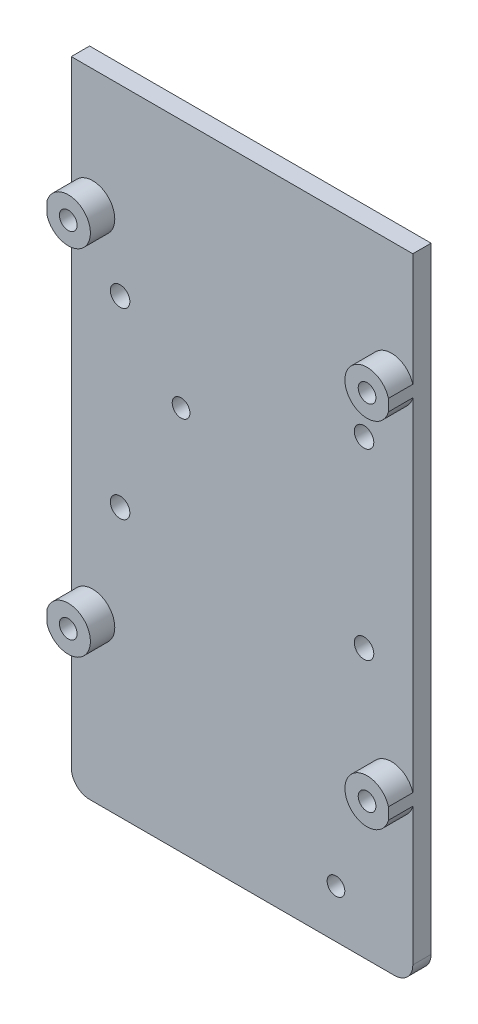
ISO-10303-21;
HEADER;
FILE_DESCRIPTION(('STEP AP214'),'2;1');
FILE_NAME('part.step','',(''),(''),'','','');
FILE_SCHEMA(('AUTOMOTIVE_DESIGN { 1 0 10303 214 1 1 1 1 }'));
ENDSEC;
DATA;
#1=APPLICATION_CONTEXT('core data for automotive mechanical design processes');
#2=APPLICATION_PROTOCOL_DEFINITION('international standard','automotive_design',2000,#1);
#3=PRODUCT_CONTEXT('',#1,'mechanical');
#4=PRODUCT('Part','Part','',(#3));
#5=PRODUCT_RELATED_PRODUCT_CATEGORY('part','',(#4));
#6=PRODUCT_DEFINITION_FORMATION('','',#4);
#7=PRODUCT_DEFINITION_CONTEXT('part definition',#1,'design');
#8=PRODUCT_DEFINITION('design','',#6,#7);
#9=PRODUCT_DEFINITION_SHAPE('','',#8);
#10=(LENGTH_UNIT() NAMED_UNIT(*) SI_UNIT(.MILLI.,.METRE.));
#11=(NAMED_UNIT(*) PLANE_ANGLE_UNIT() SI_UNIT($,.RADIAN.));
#12=(NAMED_UNIT(*) SI_UNIT($,.STERADIAN.) SOLID_ANGLE_UNIT());
#13=UNCERTAINTY_MEASURE_WITH_UNIT(LENGTH_MEASURE(1.E-05),#10,'distance_accuracy_value','');
#14=(GEOMETRIC_REPRESENTATION_CONTEXT(3) GLOBAL_UNCERTAINTY_ASSIGNED_CONTEXT((#13)) GLOBAL_UNIT_ASSIGNED_CONTEXT((#10,
#11,#12)) REPRESENTATION_CONTEXT('',''));
#15=CARTESIAN_POINT('',(0.,0.,0.));
#16=DIRECTION('',(0.,0.,1.));
#17=DIRECTION('',(1.,0.,0.));
#18=AXIS2_PLACEMENT_3D('',#15,#16,#17);
#19=CARTESIAN_POINT('',(-55.5668385634465,-35.1317121332508,3.));
#20=DIRECTION('',(0.,0.,1.));
#21=DIRECTION('',(1.,0.,0.));
#22=AXIS2_PLACEMENT_3D('',#19,#20,#21);
#23=PLANE('',#22);
#24=CARTESIAN_POINT('',(-50.5668385634462,35.8682878667493,3.));
#25=DIRECTION('',(0.,0.,1.));
#26=DIRECTION('',(1.,0.,0.));
#27=AXIS2_PLACEMENT_3D('',#24,#25,#26);
#28=CIRCLE('',#27,1.60000000000023);
#29=CARTESIAN_POINT('',(-48.966838563446,35.8682878667493,3.));
#30=VERTEX_POINT('',#29);
#31=EDGE_CURVE('E262',#30,#30,#28,.T.);
#32=ORIENTED_EDGE('',*,*,#31,.F.);
#33=EDGE_LOOP('',(#32));
#34=FACE_BOUND('',#33,.T.);
#35=CARTESIAN_POINT('',(-50.5668385634463,5.86828786674928,3.));
#36=DIRECTION('',(0.,0.,1.));
#37=DIRECTION('',(1.,0.,0.));
#38=AXIS2_PLACEMENT_3D('',#35,#36,#37);
#39=CIRCLE('',#38,1.60000000000001);
#40=CARTESIAN_POINT('',(-48.9668385634463,5.86828786674928,3.));
#41=VERTEX_POINT('',#40);
#42=EDGE_CURVE('E256',#41,#41,#39,.T.);
#43=ORIENTED_EDGE('',*,*,#42,.F.);
#44=EDGE_LOOP('',(#43));
#45=FACE_BOUND('',#44,.T.);
#46=CARTESIAN_POINT('',(-10.5668385634465,5.86828786674929,3.));
#47=DIRECTION('',(0.,0.,1.));
#48=DIRECTION('',(-1.,0.,0.));
#49=AXIS2_PLACEMENT_3D('',#46,#47,#48);
#50=CIRCLE('',#49,1.60000000000001);
#51=CARTESIAN_POINT('',(-12.1668385634465,5.86828786674929,3.));
#52=VERTEX_POINT('',#51);
#53=EDGE_CURVE('E250',#52,#52,#50,.T.);
#54=ORIENTED_EDGE('',*,*,#53,.F.);
#55=EDGE_LOOP('',(#54));
#56=FACE_BOUND('',#55,.T.);
#57=CARTESIAN_POINT('',(-10.5668385634465,35.8682878667493,3.));
#58=DIRECTION('',(0.,0.,1.));
#59=DIRECTION('',(-1.,0.,0.));
#60=AXIS2_PLACEMENT_3D('',#57,#58,#59);
#61=CIRCLE('',#60,1.60000000000023);
#62=CARTESIAN_POINT('',(-12.1668385634468,35.8682878667493,3.));
#63=VERTEX_POINT('',#62);
#64=EDGE_CURVE('E244',#63,#63,#61,.T.);
#65=ORIENTED_EDGE('',*,*,#64,.F.);
#66=EDGE_LOOP('',(#65));
#67=FACE_BOUND('',#66,.T.);
#68=CARTESIAN_POINT('',(-40.5668385634471,24.9682878667495,3.));
#69=DIRECTION('',(0.,0.,1.));
#70=DIRECTION('',(1.,0.,0.));
#71=AXIS2_PLACEMENT_3D('',#68,#69,#70);
#72=CIRCLE('',#71,1.45);
#73=CARTESIAN_POINT('',(-39.1168385634471,24.9682878667495,3.));
#74=VERTEX_POINT('',#73);
#75=EDGE_CURVE('E238',#74,#74,#72,.T.);
#76=ORIENTED_EDGE('',*,*,#75,.F.);
#77=EDGE_LOOP('',(#76));
#78=FACE_BOUND('',#77,.T.);
#79=CARTESIAN_POINT('',(-15.1668385634479,-30.2317121332502,3.));
#80=DIRECTION('',(0.,0.,1.));
#81=DIRECTION('',(1.,0.,0.));
#82=AXIS2_PLACEMENT_3D('',#79,#80,#81);
#83=CIRCLE('',#82,1.45);
#84=CARTESIAN_POINT('',(-13.7168385634479,-30.2317121332502,3.));
#85=VERTEX_POINT('',#84);
#86=EDGE_CURVE('E234',#85,#85,#83,.T.);
#87=ORIENTED_EDGE('',*,*,#86,.F.);
#88=EDGE_LOOP('',(#87));
#89=FACE_BOUND('',#88,.T.);
#90=DIRECTION('',(0.,1.,0.));
#91=VECTOR('',#90,1.);
#92=CARTESIAN_POINT('',(-2.56683856344624,-35.1317121332507,3.));
#93=LINE('',#92,#91);
#94=CARTESIAN_POINT('',(-2.56683856344624,-10.6715630343306,3.));
#95=VERTEX_POINT('',#94);
#96=CARTESIAN_POINT('',(-2.56683856344624,45.4081387678292,3.));
#97=VERTEX_POINT('',#96);
#98=EDGE_CURVE('E52',#95,#97,#93,.T.);
#99=ORIENTED_EDGE('',*,*,#98,.T.);
#100=CARTESIAN_POINT('',(-6.06683856344624,46.3682878667493,3.));
#101=DIRECTION('',(0.,0.,1.));
#102=DIRECTION('',(1.,0.,0.));
#103=AXIS2_PLACEMENT_3D('',#100,#101,#102);
#104=CIRCLE('',#103,3.62930934092936);
#105=CARTESIAN_POINT('',(-2.56683856344624,47.3284369656694,3.));
#106=VERTEX_POINT('',#105);
#107=EDGE_CURVE('E629',#106,#97,#104,.T.);
#108=ORIENTED_EDGE('',*,*,#107,.F.);
#109=CARTESIAN_POINT('',(-2.56683856344624,65.8682878667496,3.));
#110=VERTEX_POINT('',#109);
#111=EDGE_CURVE('E155',#106,#110,#93,.T.);
#112=ORIENTED_EDGE('',*,*,#111,.T.);
#113=DIRECTION('',(-1.,0.,0.));
#114=VECTOR('',#113,1.);
#115=CARTESIAN_POINT('',(-2.56683856344624,65.8682878667496,3.));
#116=LINE('',#115,#114);
#117=CARTESIAN_POINT('',(-58.5668385634464,65.8682878667493,3.));
#118=VERTEX_POINT('',#117);
#119=EDGE_CURVE('E280',#110,#118,#116,.T.);
#120=ORIENTED_EDGE('',*,*,#119,.T.);
#121=DIRECTION('',(0.,-1.,0.));
#122=VECTOR('',#121,1.);
#123=CARTESIAN_POINT('',(-58.5668385634464,65.8682878667493,3.));
#124=LINE('',#123,#122);
#125=CARTESIAN_POINT('',(-58.5668385634464,47.3284369656703,3.));
#126=VERTEX_POINT('',#125);
#127=EDGE_CURVE('E286',#118,#126,#124,.T.);
#128=ORIENTED_EDGE('',*,*,#127,.T.);
#129=CARTESIAN_POINT('',(-55.0668385634466,46.3682878667495,3.));
#130=DIRECTION('',(0.,0.,1.));
#131=DIRECTION('',(1.,0.,0.));
#132=AXIS2_PLACEMENT_3D('',#129,#130,#131);
#133=CIRCLE('',#132,3.62930934092936);
#134=CARTESIAN_POINT('',(-58.5668385634464,45.4081387678288,3.));
#135=VERTEX_POINT('',#134);
#136=EDGE_CURVE('E176',#135,#126,#133,.T.);
#137=ORIENTED_EDGE('',*,*,#136,.F.);
#138=CARTESIAN_POINT('',(-58.5668385634464,-10.6715630343281,3.));
#139=VERTEX_POINT('',#138);
#140=EDGE_CURVE('E38',#135,#139,#124,.T.);
#141=ORIENTED_EDGE('',*,*,#140,.T.);
#142=CARTESIAN_POINT('',(-55.066838563447,-11.6317121332505,3.));
#143=DIRECTION('',(0.,0.,1.));
#144=DIRECTION('',(1.,0.,0.));
#145=AXIS2_PLACEMENT_3D('',#142,#143,#144);
#146=CIRCLE('',#145,3.62930934092936);
#147=CARTESIAN_POINT('',(-58.5668385634464,-12.5918612321729,3.));
#148=VERTEX_POINT('',#147);
#149=EDGE_CURVE('E191',#148,#139,#146,.T.);
#150=ORIENTED_EDGE('',*,*,#149,.F.);
#151=CARTESIAN_POINT('',(-58.5668385634464,-35.1317121332508,3.));
#152=VERTEX_POINT('',#151);
#153=EDGE_CURVE('E209',#148,#152,#124,.T.);
#154=ORIENTED_EDGE('',*,*,#153,.T.);
#155=CARTESIAN_POINT('',(-55.5668385634465,-35.1317121332508,3.));
#156=DIRECTION('',(0.,0.,1.));
#157=DIRECTION('',(1.,0.,0.));
#158=AXIS2_PLACEMENT_3D('',#155,#156,#157);
#159=CIRCLE('',#158,2.99999999999995);
#160=CARTESIAN_POINT('',(-55.5668385634479,-38.1317121332507,3.));
#161=VERTEX_POINT('',#160);
#162=EDGE_CURVE('E271',#152,#161,#159,.T.);
#163=ORIENTED_EDGE('',*,*,#162,.T.);
#164=DIRECTION('',(1.,0.,0.));
#165=VECTOR('',#164,1.);
#166=CARTESIAN_POINT('',(-55.5668385634479,-38.1317121332507,3.));
#167=LINE('',#166,#165);
#168=CARTESIAN_POINT('',(-5.56683856344491,-38.1317121332507,3.));
#169=VERTEX_POINT('',#168);
#170=EDGE_CURVE('E274',#161,#169,#167,.T.);
#171=ORIENTED_EDGE('',*,*,#170,.T.);
#172=CARTESIAN_POINT('',(-5.56683856344638,-35.1317121332506,3.));
#173=DIRECTION('',(0.,0.,1.));
#174=DIRECTION('',(1.,0.,0.));
#175=AXIS2_PLACEMENT_3D('',#172,#173,#174);
#176=CIRCLE('',#175,3.00000000000013);
#177=CARTESIAN_POINT('',(-2.56683856344624,-35.1317121332507,3.));
#178=VERTEX_POINT('',#177);
#179=EDGE_CURVE('E277',#169,#178,#176,.T.);
#180=ORIENTED_EDGE('',*,*,#179,.T.);
#181=CARTESIAN_POINT('',(-2.56683856344624,-12.5918612321708,3.));
#182=VERTEX_POINT('',#181);
#183=EDGE_CURVE('E58',#178,#182,#93,.T.);
#184=ORIENTED_EDGE('',*,*,#183,.T.);
#185=CARTESIAN_POINT('',(-6.06683856344624,-11.6317121332507,3.));
#186=DIRECTION('',(0.,0.,1.));
#187=DIRECTION('',(1.,0.,0.));
#188=AXIS2_PLACEMENT_3D('',#185,#186,#187);
#189=CIRCLE('',#188,3.62930934092936);
#190=EDGE_CURVE('E156',#95,#182,#189,.T.);
#191=ORIENTED_EDGE('',*,*,#190,.F.);
#192=EDGE_LOOP('',(#99,#108,#112,#120,#128,#137,#141,#150,#154,#163,#171,#180,#184,#191));
#193=FACE_BOUND('',#192,.T.);
#194=ADVANCED_FACE('F34',(#34,#45,#56,#67,#78,#89,#193),#23,.T.);
#195=CARTESIAN_POINT('',(-55.5668385634465,-35.1317121332508,3.));
#196=DIRECTION('',(0.,0.,-1.));
#197=DIRECTION('',(-1.,0.,0.));
#198=AXIS2_PLACEMENT_3D('',#195,#196,#197);
#199=CYLINDRICAL_SURFACE('',#198,2.99999999999995);
#200=CARTESIAN_POINT('',(-55.5668385634465,-35.1317121332508,0.));
#201=DIRECTION('',(0.,0.,1.));
#202=DIRECTION('',(1.,0.,0.));
#203=AXIS2_PLACEMENT_3D('',#200,#201,#202);
#204=CIRCLE('',#203,2.99999999999995);
#205=CARTESIAN_POINT('',(-58.5668385634464,-35.1317121332508,0.));
#206=VERTEX_POINT('',#205);
#207=CARTESIAN_POINT('',(-55.5668385634479,-38.1317121332507,0.));
#208=VERTEX_POINT('',#207);
#209=EDGE_CURVE('E268',#206,#208,#204,.T.);
#210=ORIENTED_EDGE('',*,*,#209,.T.);
#211=DIRECTION('',(0.,0.,-1.));
#212=VECTOR('',#211,1.);
#213=CARTESIAN_POINT('',(-55.5668385634479,-38.1317121332507,3.));
#214=LINE('',#213,#212);
#215=EDGE_CURVE('E11',#161,#208,#214,.T.);
#216=ORIENTED_EDGE('',*,*,#215,.F.);
#217=ORIENTED_EDGE('',*,*,#162,.F.);
#218=DIRECTION('',(0.,0.,-1.));
#219=VECTOR('',#218,1.);
#220=CARTESIAN_POINT('',(-58.5668385634464,-35.1317121332508,3.));
#221=LINE('',#220,#219);
#222=EDGE_CURVE('E288',#152,#206,#221,.T.);
#223=ORIENTED_EDGE('',*,*,#222,.T.);
#224=EDGE_LOOP('',(#210,#216,#217,#223));
#225=FACE_BOUND('',#224,.T.);
#226=ADVANCED_FACE('F36',(#225),#199,.T.);
#227=CARTESIAN_POINT('',(-55.5668385634479,-38.1317121332507,3.));
#228=DIRECTION('',(0.,1.,0.));
#229=DIRECTION('',(0.,0.,1.));
#230=AXIS2_PLACEMENT_3D('',#227,#228,#229);
#231=PLANE('',#230);
#232=DIRECTION('',(1.,0.,0.));
#233=VECTOR('',#232,1.);
#234=CARTESIAN_POINT('',(-55.5668385634479,-38.1317121332507,0.));
#235=LINE('',#234,#233);
#236=CARTESIAN_POINT('',(-5.56683856344491,-38.1317121332507,0.));
#237=VERTEX_POINT('',#236);
#238=EDGE_CURVE('E309',#208,#237,#235,.T.);
#239=ORIENTED_EDGE('',*,*,#238,.T.);
#240=DIRECTION('',(0.,0.,-1.));
#241=VECTOR('',#240,1.);
#242=CARTESIAN_POINT('',(-5.56683856344491,-38.1317121332507,3.));
#243=LINE('',#242,#241);
#244=EDGE_CURVE('E44',#169,#237,#243,.T.);
#245=ORIENTED_EDGE('',*,*,#244,.F.);
#246=ORIENTED_EDGE('',*,*,#170,.F.);
#247=ORIENTED_EDGE('',*,*,#215,.T.);
#248=EDGE_LOOP('',(#239,#245,#246,#247));
#249=FACE_BOUND('',#248,.T.);
#250=ADVANCED_FACE('F324',(#249),#231,.F.);
#251=CARTESIAN_POINT('',(-5.56683856344638,-35.1317121332506,3.));
#252=DIRECTION('',(0.,0.,-1.));
#253=DIRECTION('',(-1.,0.,0.));
#254=AXIS2_PLACEMENT_3D('',#251,#252,#253);
#255=CYLINDRICAL_SURFACE('',#254,3.00000000000013);
#256=CARTESIAN_POINT('',(-5.56683856344638,-35.1317121332506,0.));
#257=DIRECTION('',(0.,0.,1.));
#258=DIRECTION('',(1.,0.,0.));
#259=AXIS2_PLACEMENT_3D('',#256,#257,#258);
#260=CIRCLE('',#259,3.00000000000013);
#261=CARTESIAN_POINT('',(-2.56683856344624,-35.1317121332507,0.));
#262=VERTEX_POINT('',#261);
#263=EDGE_CURVE('E308',#237,#262,#260,.T.);
#264=ORIENTED_EDGE('',*,*,#263,.T.);
#265=DIRECTION('',(0.,0.,-1.));
#266=VECTOR('',#265,1.);
#267=CARTESIAN_POINT('',(-2.56683856344624,-35.1317121332507,3.));
#268=LINE('',#267,#266);
#269=EDGE_CURVE('E292',#178,#262,#268,.T.);
#270=ORIENTED_EDGE('',*,*,#269,.F.);
#271=ORIENTED_EDGE('',*,*,#179,.F.);
#272=ORIENTED_EDGE('',*,*,#244,.T.);
#273=EDGE_LOOP('',(#264,#270,#271,#272));
#274=FACE_BOUND('',#273,.T.);
#275=ADVANCED_FACE('F336',(#274),#255,.T.);
#276=CARTESIAN_POINT('',(-2.56683856344624,-35.1317121332507,3.));
#277=DIRECTION('',(-1.,0.,0.));
#278=DIRECTION('',(0.,0.,1.));
#279=AXIS2_PLACEMENT_3D('',#276,#277,#278);
#280=PLANE('',#279);
#281=DIRECTION('',(0.,1.,0.));
#282=VECTOR('',#281,1.);
#283=CARTESIAN_POINT('',(-2.56683856344624,-35.1317121332507,0.));
#284=LINE('',#283,#282);
#285=CARTESIAN_POINT('',(-2.56683856344624,65.8682878667496,0.));
#286=VERTEX_POINT('',#285);
#287=EDGE_CURVE('E306',#262,#286,#284,.T.);
#288=ORIENTED_EDGE('',*,*,#287,.T.);
#289=DIRECTION('',(0.,0.,-1.));
#290=VECTOR('',#289,1.);
#291=CARTESIAN_POINT('',(-2.56683856344624,65.8682878667496,3.));
#292=LINE('',#291,#290);
#293=EDGE_CURVE('E295',#110,#286,#292,.T.);
#294=ORIENTED_EDGE('',*,*,#293,.F.);
#295=ORIENTED_EDGE('',*,*,#111,.F.);
#296=DIRECTION('',(0.,0.,-1.));
#297=VECTOR('',#296,1.);
#298=CARTESIAN_POINT('',(-2.56683856344624,47.3284369656694,7.));
#299=LINE('',#298,#297);
#300=CARTESIAN_POINT('',(-2.56683856344624,47.3284369656694,7.));
#301=VERTEX_POINT('',#300);
#302=EDGE_CURVE('E142',#301,#106,#299,.T.);
#303=ORIENTED_EDGE('',*,*,#302,.F.);
#304=DIRECTION('',(0.,1.,0.));
#305=VECTOR('',#304,1.);
#306=CARTESIAN_POINT('',(-2.56683856344624,0.,7.));
#307=LINE('',#306,#305);
#308=CARTESIAN_POINT('',(-2.56683856344624,45.4081387678292,7.));
#309=VERTEX_POINT('',#308);
#310=EDGE_CURVE('E147',#309,#301,#307,.T.);
#311=ORIENTED_EDGE('',*,*,#310,.F.);
#312=DIRECTION('',(0.,0.,-1.));
#313=VECTOR('',#312,1.);
#314=CARTESIAN_POINT('',(-2.56683856344624,45.4081387678292,7.));
#315=LINE('',#314,#313);
#316=EDGE_CURVE('E144',#309,#97,#315,.T.);
#317=ORIENTED_EDGE('',*,*,#316,.T.);
#318=ORIENTED_EDGE('',*,*,#98,.F.);
#319=DIRECTION('',(0.,0.,-1.));
#320=VECTOR('',#319,1.);
#321=CARTESIAN_POINT('',(-2.56683856344624,-10.6715630343306,7.));
#322=LINE('',#321,#320);
#323=CARTESIAN_POINT('',(-2.56683856344624,-10.6715630343306,7.));
#324=VERTEX_POINT('',#323);
#325=EDGE_CURVE('E173',#324,#95,#322,.T.);
#326=ORIENTED_EDGE('',*,*,#325,.F.);
#327=DIRECTION('',(0.,1.,0.));
#328=VECTOR('',#327,1.);
#329=CARTESIAN_POINT('',(-2.56683856344624,0.,7.));
#330=LINE('',#329,#328);
#331=CARTESIAN_POINT('',(-2.56683856344624,-12.5918612321708,7.));
#332=VERTEX_POINT('',#331);
#333=EDGE_CURVE('E165',#332,#324,#330,.T.);
#334=ORIENTED_EDGE('',*,*,#333,.F.);
#335=DIRECTION('',(0.,0.,-1.));
#336=VECTOR('',#335,1.);
#337=CARTESIAN_POINT('',(-2.56683856344624,-12.5918612321708,7.));
#338=LINE('',#337,#336);
#339=EDGE_CURVE('E169',#332,#182,#338,.T.);
#340=ORIENTED_EDGE('',*,*,#339,.T.);
#341=ORIENTED_EDGE('',*,*,#183,.F.);
#342=ORIENTED_EDGE('',*,*,#269,.T.);
#343=EDGE_LOOP('',(#288,#294,#295,#303,#311,#317,#318,#326,#334,#340,#341,#342));
#344=FACE_BOUND('',#343,.T.);
#345=ADVANCED_FACE('F153',(#344),#280,.F.);
#346=CARTESIAN_POINT('',(-2.56683856344624,65.8682878667496,3.));
#347=DIRECTION('',(0.,-1.,0.));
#348=DIRECTION('',(1.,0.,0.));
#349=AXIS2_PLACEMENT_3D('',#346,#347,#348);
#350=PLANE('',#349);
#351=DIRECTION('',(-1.,0.,0.));
#352=VECTOR('',#351,1.);
#353=CARTESIAN_POINT('',(-2.56683856344624,65.8682878667496,0.));
#354=LINE('',#353,#352);
#355=CARTESIAN_POINT('',(-58.5668385634464,65.8682878667493,0.));
#356=VERTEX_POINT('',#355);
#357=EDGE_CURVE('E304',#286,#356,#354,.T.);
#358=ORIENTED_EDGE('',*,*,#357,.T.);
#359=DIRECTION('',(0.,0.,-1.));
#360=VECTOR('',#359,1.);
#361=CARTESIAN_POINT('',(-58.5668385634464,65.8682878667493,3.));
#362=LINE('',#361,#360);
#363=EDGE_CURVE('E298',#118,#356,#362,.T.);
#364=ORIENTED_EDGE('',*,*,#363,.F.);
#365=ORIENTED_EDGE('',*,*,#119,.F.);
#366=ORIENTED_EDGE('',*,*,#293,.T.);
#367=EDGE_LOOP('',(#358,#364,#365,#366));
#368=FACE_BOUND('',#367,.T.);
#369=ADVANCED_FACE('F333',(#368),#350,.F.);
#370=CARTESIAN_POINT('',(-58.5668385634464,65.8682878667493,3.));
#371=DIRECTION('',(1.,0.,0.));
#372=DIRECTION('',(0.,0.,-1.));
#373=AXIS2_PLACEMENT_3D('',#370,#371,#372);
#374=PLANE('',#373);
#375=DIRECTION('',(0.,-1.,0.));
#376=VECTOR('',#375,1.);
#377=CARTESIAN_POINT('',(-58.5668385634464,65.8682878667493,0.));
#378=LINE('',#377,#376);
#379=EDGE_CURVE('E275',#356,#206,#378,.T.);
#380=ORIENTED_EDGE('',*,*,#379,.T.);
#381=ORIENTED_EDGE('',*,*,#222,.F.);
#382=ORIENTED_EDGE('',*,*,#153,.F.);
#383=DIRECTION('',(0.,0.,-1.));
#384=VECTOR('',#383,1.);
#385=CARTESIAN_POINT('',(-58.5668385634464,-12.5918612321729,7.));
#386=LINE('',#385,#384);
#387=CARTESIAN_POINT('',(-58.5668385634464,-12.5918612321729,7.));
#388=VERTEX_POINT('',#387);
#389=EDGE_CURVE('E213',#388,#148,#386,.T.);
#390=ORIENTED_EDGE('',*,*,#389,.F.);
#391=DIRECTION('',(0.,-1.,0.));
#392=VECTOR('',#391,1.);
#393=CARTESIAN_POINT('',(-58.5668385634464,0.,7.));
#394=LINE('',#393,#392);
#395=CARTESIAN_POINT('',(-58.5668385634464,-10.6715630343281,7.));
#396=VERTEX_POINT('',#395);
#397=EDGE_CURVE('E195',#396,#388,#394,.T.);
#398=ORIENTED_EDGE('',*,*,#397,.F.);
#399=DIRECTION('',(0.,0.,-1.));
#400=VECTOR('',#399,1.);
#401=CARTESIAN_POINT('',(-58.5668385634464,-10.6715630343281,7.));
#402=LINE('',#401,#400);
#403=EDGE_CURVE('E200',#396,#139,#402,.T.);
#404=ORIENTED_EDGE('',*,*,#403,.T.);
#405=ORIENTED_EDGE('',*,*,#140,.F.);
#406=DIRECTION('',(0.,0.,-1.));
#407=VECTOR('',#406,1.);
#408=CARTESIAN_POINT('',(-58.5668385634464,45.4081387678288,7.));
#409=LINE('',#408,#407);
#410=CARTESIAN_POINT('',(-58.5668385634464,45.4081387678288,7.));
#411=VERTEX_POINT('',#410);
#412=EDGE_CURVE('E189',#411,#135,#409,.T.);
#413=ORIENTED_EDGE('',*,*,#412,.F.);
#414=DIRECTION('',(0.,-1.,0.));
#415=VECTOR('',#414,1.);
#416=CARTESIAN_POINT('',(-58.5668385634464,0.,7.));
#417=LINE('',#416,#415);
#418=CARTESIAN_POINT('',(-58.5668385634464,47.3284369656703,7.));
#419=VERTEX_POINT('',#418);
#420=EDGE_CURVE('E180',#419,#411,#417,.T.);
#421=ORIENTED_EDGE('',*,*,#420,.F.);
#422=DIRECTION('',(0.,0.,-1.));
#423=VECTOR('',#422,1.);
#424=CARTESIAN_POINT('',(-58.5668385634464,47.3284369656703,7.));
#425=LINE('',#424,#423);
#426=EDGE_CURVE('E185',#419,#126,#425,.T.);
#427=ORIENTED_EDGE('',*,*,#426,.T.);
#428=ORIENTED_EDGE('',*,*,#127,.F.);
#429=ORIENTED_EDGE('',*,*,#363,.T.);
#430=EDGE_LOOP('',(#380,#381,#382,#390,#398,#404,#405,#413,#421,#427,#428,#429));
#431=FACE_BOUND('',#430,.T.);
#432=ADVANCED_FACE('F328',(#431),#374,.F.);
#433=CARTESIAN_POINT('',(-55.5668385634465,-35.1317121332508,0.));
#434=DIRECTION('',(0.,0.,1.));
#435=DIRECTION('',(1.,0.,0.));
#436=AXIS2_PLACEMENT_3D('',#433,#434,#435);
#437=PLANE('',#436);
#438=CARTESIAN_POINT('',(-55.0668385634466,46.3682878667495,0.));
#439=DIRECTION('',(0.,0.,1.));
#440=DIRECTION('',(-1.,0.,0.));
#441=AXIS2_PLACEMENT_3D('',#438,#439,#440);
#442=CIRCLE('',#441,1.45);
#443=CARTESIAN_POINT('',(-56.5168385634466,46.3682878667495,0.));
#444=VERTEX_POINT('',#443);
#445=EDGE_CURVE('E203',#444,#444,#442,.T.);
#446=ORIENTED_EDGE('',*,*,#445,.T.);
#447=EDGE_LOOP('',(#446));
#448=FACE_BOUND('',#447,.T.);
#449=CARTESIAN_POINT('',(-55.066838563447,-11.6317121332505,0.));
#450=DIRECTION('',(0.,0.,1.));
#451=DIRECTION('',(-1.,0.,0.));
#452=AXIS2_PLACEMENT_3D('',#449,#450,#451);
#453=CIRCLE('',#452,1.45);
#454=CARTESIAN_POINT('',(-56.516838563447,-11.6317121332505,0.));
#455=VERTEX_POINT('',#454);
#456=EDGE_CURVE('E221',#455,#455,#453,.T.);
#457=ORIENTED_EDGE('',*,*,#456,.T.);
#458=EDGE_LOOP('',(#457));
#459=FACE_BOUND('',#458,.T.);
#460=CARTESIAN_POINT('',(-6.06683856344624,-11.6317121332507,0.));
#461=DIRECTION('',(0.,0.,1.));
#462=DIRECTION('',(1.,0.,0.));
#463=AXIS2_PLACEMENT_3D('',#460,#461,#462);
#464=CIRCLE('',#463,1.45);
#465=CARTESIAN_POINT('',(-4.61683856344624,-11.6317121332507,0.));
#466=VERTEX_POINT('',#465);
#467=EDGE_CURVE('E225',#466,#466,#464,.T.);
#468=ORIENTED_EDGE('',*,*,#467,.T.);
#469=EDGE_LOOP('',(#468));
#470=FACE_BOUND('',#469,.T.);
#471=CARTESIAN_POINT('',(-6.06683856344624,46.3682878667493,0.));
#472=DIRECTION('',(0.,0.,1.));
#473=DIRECTION('',(1.,0.,0.));
#474=AXIS2_PLACEMENT_3D('',#471,#472,#473);
#475=CIRCLE('',#474,1.45);
#476=CARTESIAN_POINT('',(-4.61683856344624,46.3682878667493,0.));
#477=VERTEX_POINT('',#476);
#478=EDGE_CURVE('E229',#477,#477,#475,.T.);
#479=ORIENTED_EDGE('',*,*,#478,.T.);
#480=EDGE_LOOP('',(#479));
#481=FACE_BOUND('',#480,.T.);
#482=CARTESIAN_POINT('',(-15.1668385634479,-30.2317121332502,0.));
#483=DIRECTION('',(0.,0.,1.));
#484=DIRECTION('',(1.,0.,0.));
#485=AXIS2_PLACEMENT_3D('',#482,#483,#484);
#486=CIRCLE('',#485,1.45);
#487=CARTESIAN_POINT('',(-13.7168385634479,-30.2317121332502,0.));
#488=VERTEX_POINT('',#487);
#489=EDGE_CURVE('E235',#488,#488,#486,.T.);
#490=ORIENTED_EDGE('',*,*,#489,.T.);
#491=EDGE_LOOP('',(#490));
#492=FACE_BOUND('',#491,.T.);
#493=CARTESIAN_POINT('',(-40.5668385634471,24.9682878667495,0.));
#494=DIRECTION('',(0.,0.,1.));
#495=DIRECTION('',(1.,0.,0.));
#496=AXIS2_PLACEMENT_3D('',#493,#494,#495);
#497=CIRCLE('',#496,1.45);
#498=CARTESIAN_POINT('',(-39.1168385634471,24.9682878667495,0.));
#499=VERTEX_POINT('',#498);
#500=EDGE_CURVE('E241',#499,#499,#497,.T.);
#501=ORIENTED_EDGE('',*,*,#500,.T.);
#502=EDGE_LOOP('',(#501));
#503=FACE_BOUND('',#502,.T.);
#504=CARTESIAN_POINT('',(-10.5668385634465,35.8682878667493,0.));
#505=DIRECTION('',(0.,0.,1.));
#506=DIRECTION('',(-1.,0.,0.));
#507=AXIS2_PLACEMENT_3D('',#504,#505,#506);
#508=CIRCLE('',#507,1.60000000000023);
#509=CARTESIAN_POINT('',(-12.1668385634468,35.8682878667493,0.));
#510=VERTEX_POINT('',#509);
#511=EDGE_CURVE('E247',#510,#510,#508,.T.);
#512=ORIENTED_EDGE('',*,*,#511,.T.);
#513=EDGE_LOOP('',(#512));
#514=FACE_BOUND('',#513,.T.);
#515=CARTESIAN_POINT('',(-10.5668385634465,5.86828786674929,0.));
#516=DIRECTION('',(0.,0.,1.));
#517=DIRECTION('',(-1.,0.,0.));
#518=AXIS2_PLACEMENT_3D('',#515,#516,#517);
#519=CIRCLE('',#518,1.60000000000001);
#520=CARTESIAN_POINT('',(-12.1668385634465,5.86828786674929,0.));
#521=VERTEX_POINT('',#520);
#522=EDGE_CURVE('E253',#521,#521,#519,.T.);
#523=ORIENTED_EDGE('',*,*,#522,.T.);
#524=EDGE_LOOP('',(#523));
#525=FACE_BOUND('',#524,.T.);
#526=CARTESIAN_POINT('',(-50.5668385634463,5.86828786674928,0.));
#527=DIRECTION('',(0.,0.,1.));
#528=DIRECTION('',(1.,0.,0.));
#529=AXIS2_PLACEMENT_3D('',#526,#527,#528);
#530=CIRCLE('',#529,1.60000000000001);
#531=CARTESIAN_POINT('',(-48.9668385634463,5.86828786674928,0.));
#532=VERTEX_POINT('',#531);
#533=EDGE_CURVE('E259',#532,#532,#530,.T.);
#534=ORIENTED_EDGE('',*,*,#533,.T.);
#535=EDGE_LOOP('',(#534));
#536=FACE_BOUND('',#535,.T.);
#537=CARTESIAN_POINT('',(-50.5668385634462,35.8682878667493,0.));
#538=DIRECTION('',(0.,0.,1.));
#539=DIRECTION('',(1.,0.,0.));
#540=AXIS2_PLACEMENT_3D('',#537,#538,#539);
#541=CIRCLE('',#540,1.60000000000023);
#542=CARTESIAN_POINT('',(-48.966838563446,35.8682878667493,0.));
#543=VERTEX_POINT('',#542);
#544=EDGE_CURVE('E265',#543,#543,#541,.T.);
#545=ORIENTED_EDGE('',*,*,#544,.T.);
#546=EDGE_LOOP('',(#545));
#547=FACE_BOUND('',#546,.T.);
#548=ORIENTED_EDGE('',*,*,#209,.F.);
#549=ORIENTED_EDGE('',*,*,#379,.F.);
#550=ORIENTED_EDGE('',*,*,#357,.F.);
#551=ORIENTED_EDGE('',*,*,#287,.F.);
#552=ORIENTED_EDGE('',*,*,#263,.F.);
#553=ORIENTED_EDGE('',*,*,#238,.F.);
#554=EDGE_LOOP('',(#548,#549,#550,#551,#552,#553));
#555=FACE_BOUND('',#554,.T.);
#556=ADVANCED_FACE('F320',(#448,#459,#470,#481,#492,#503,#514,#525,#536,#547,#555),#437,.F.);
#557=CARTESIAN_POINT('',(-50.5668385634462,35.8682878667493,0.));
#558=DIRECTION('',(0.,0.,1.));
#559=DIRECTION('',(1.,0.,0.));
#560=AXIS2_PLACEMENT_3D('',#557,#558,#559);
#561=CYLINDRICAL_SURFACE('',#560,1.60000000000023);
#562=ORIENTED_EDGE('',*,*,#544,.F.);
#563=EDGE_LOOP('',(#562));
#564=FACE_BOUND('',#563,.T.);
#565=ORIENTED_EDGE('',*,*,#31,.T.);
#566=EDGE_LOOP('',(#565));
#567=FACE_BOUND('',#566,.T.);
#568=ADVANCED_FACE('F354',(#564,#567),#561,.F.);
#569=CARTESIAN_POINT('',(-50.5668385634463,5.86828786674928,0.));
#570=DIRECTION('',(0.,0.,1.));
#571=DIRECTION('',(1.,0.,0.));
#572=AXIS2_PLACEMENT_3D('',#569,#570,#571);
#573=CYLINDRICAL_SURFACE('',#572,1.60000000000001);
#574=ORIENTED_EDGE('',*,*,#533,.F.);
#575=EDGE_LOOP('',(#574));
#576=FACE_BOUND('',#575,.T.);
#577=ORIENTED_EDGE('',*,*,#42,.T.);
#578=EDGE_LOOP('',(#577));
#579=FACE_BOUND('',#578,.T.);
#580=ADVANCED_FACE('F380',(#576,#579),#573,.F.);
#581=CARTESIAN_POINT('',(-10.5668385634465,5.86828786674929,0.));
#582=DIRECTION('',(0.,0.,1.));
#583=DIRECTION('',(1.,0.,0.));
#584=AXIS2_PLACEMENT_3D('',#581,#582,#583);
#585=CYLINDRICAL_SURFACE('',#584,1.60000000000001);
#586=ORIENTED_EDGE('',*,*,#522,.F.);
#587=EDGE_LOOP('',(#586));
#588=FACE_BOUND('',#587,.T.);
#589=ORIENTED_EDGE('',*,*,#53,.T.);
#590=EDGE_LOOP('',(#589));
#591=FACE_BOUND('',#590,.T.);
#592=ADVANCED_FACE('F387',(#588,#591),#585,.F.);
#593=CARTESIAN_POINT('',(-10.5668385634465,35.8682878667493,0.));
#594=DIRECTION('',(0.,0.,1.));
#595=DIRECTION('',(1.,0.,0.));
#596=AXIS2_PLACEMENT_3D('',#593,#594,#595);
#597=CYLINDRICAL_SURFACE('',#596,1.60000000000023);
#598=ORIENTED_EDGE('',*,*,#511,.F.);
#599=EDGE_LOOP('',(#598));
#600=FACE_BOUND('',#599,.T.);
#601=ORIENTED_EDGE('',*,*,#64,.T.);
#602=EDGE_LOOP('',(#601));
#603=FACE_BOUND('',#602,.T.);
#604=ADVANCED_FACE('F394',(#600,#603),#597,.F.);
#605=CARTESIAN_POINT('',(-40.5668385634471,24.9682878667495,0.));
#606=DIRECTION('',(0.,0.,1.));
#607=DIRECTION('',(1.,0.,0.));
#608=AXIS2_PLACEMENT_3D('',#605,#606,#607);
#609=CYLINDRICAL_SURFACE('',#608,1.45);
#610=ORIENTED_EDGE('',*,*,#500,.F.);
#611=EDGE_LOOP('',(#610));
#612=FACE_BOUND('',#611,.T.);
#613=ORIENTED_EDGE('',*,*,#75,.T.);
#614=EDGE_LOOP('',(#613));
#615=FACE_BOUND('',#614,.T.);
#616=ADVANCED_FACE('F402',(#612,#615),#609,.F.);
#617=CARTESIAN_POINT('',(-15.1668385634479,-30.2317121332502,0.));
#618=DIRECTION('',(0.,0.,1.));
#619=DIRECTION('',(1.,0.,0.));
#620=AXIS2_PLACEMENT_3D('',#617,#618,#619);
#621=CYLINDRICAL_SURFACE('',#620,1.45);
#622=ORIENTED_EDGE('',*,*,#489,.F.);
#623=EDGE_LOOP('',(#622));
#624=FACE_BOUND('',#623,.T.);
#625=ORIENTED_EDGE('',*,*,#86,.T.);
#626=EDGE_LOOP('',(#625));
#627=FACE_BOUND('',#626,.T.);
#628=ADVANCED_FACE('F410',(#624,#627),#621,.F.);
#629=CARTESIAN_POINT('',(-6.06683856344624,46.3682878667493,0.));
#630=DIRECTION('',(0.,0.,1.));
#631=DIRECTION('',(1.,0.,0.));
#632=AXIS2_PLACEMENT_3D('',#629,#630,#631);
#633=CYLINDRICAL_SURFACE('',#632,1.45);
#634=ORIENTED_EDGE('',*,*,#478,.F.);
#635=EDGE_LOOP('',(#634));
#636=FACE_BOUND('',#635,.T.);
#637=CARTESIAN_POINT('',(-6.06683856344624,46.3682878667493,7.));
#638=DIRECTION('',(0.,0.,1.));
#639=DIRECTION('',(1.,0.,0.));
#640=AXIS2_PLACEMENT_3D('',#637,#638,#639);
#641=CIRCLE('',#640,1.45);
#642=CARTESIAN_POINT('',(-4.61683856344624,46.3682878667493,7.));
#643=VERTEX_POINT('',#642);
#644=EDGE_CURVE('E151',#643,#643,#641,.F.);
#645=ORIENTED_EDGE('',*,*,#644,.F.);
#646=EDGE_LOOP('',(#645));
#647=FACE_BOUND('',#646,.T.);
#648=ADVANCED_FACE('F418',(#636,#647),#633,.F.);
#649=CARTESIAN_POINT('',(-6.06683856344624,-11.6317121332507,0.));
#650=DIRECTION('',(0.,0.,1.));
#651=DIRECTION('',(1.,0.,0.));
#652=AXIS2_PLACEMENT_3D('',#649,#650,#651);
#653=CYLINDRICAL_SURFACE('',#652,1.45);
#654=ORIENTED_EDGE('',*,*,#467,.F.);
#655=EDGE_LOOP('',(#654));
#656=FACE_BOUND('',#655,.T.);
#657=CARTESIAN_POINT('',(-6.06683856344624,-11.6317121332507,7.));
#658=DIRECTION('',(0.,0.,1.));
#659=DIRECTION('',(1.,0.,0.));
#660=AXIS2_PLACEMENT_3D('',#657,#658,#659);
#661=CIRCLE('',#660,1.45);
#662=CARTESIAN_POINT('',(-4.61683856344624,-11.6317121332507,7.));
#663=VERTEX_POINT('',#662);
#664=EDGE_CURVE('E158',#663,#663,#661,.F.);
#665=ORIENTED_EDGE('',*,*,#664,.F.);
#666=EDGE_LOOP('',(#665));
#667=FACE_BOUND('',#666,.T.);
#668=ADVANCED_FACE('F425',(#656,#667),#653,.F.);
#669=CARTESIAN_POINT('',(-55.066838563447,-11.6317121332505,0.));
#670=DIRECTION('',(0.,0.,1.));
#671=DIRECTION('',(1.,0.,0.));
#672=AXIS2_PLACEMENT_3D('',#669,#670,#671);
#673=CYLINDRICAL_SURFACE('',#672,1.45);
#674=ORIENTED_EDGE('',*,*,#456,.F.);
#675=EDGE_LOOP('',(#674));
#676=FACE_BOUND('',#675,.T.);
#677=CARTESIAN_POINT('',(-55.066838563447,-11.6317121332505,7.));
#678=DIRECTION('',(0.,0.,1.));
#679=DIRECTION('',(1.,0.,0.));
#680=AXIS2_PLACEMENT_3D('',#677,#678,#679);
#681=CIRCLE('',#680,1.45);
#682=CARTESIAN_POINT('',(-53.616838563447,-11.6317121332505,7.));
#683=VERTEX_POINT('',#682);
#684=EDGE_CURVE('E192',#683,#683,#681,.F.);
#685=ORIENTED_EDGE('',*,*,#684,.F.);
#686=EDGE_LOOP('',(#685));
#687=FACE_BOUND('',#686,.T.);
#688=ADVANCED_FACE('F433',(#676,#687),#673,.F.);
#689=CARTESIAN_POINT('',(-55.0668385634466,46.3682878667495,0.));
#690=DIRECTION('',(0.,0.,1.));
#691=DIRECTION('',(1.,0.,0.));
#692=AXIS2_PLACEMENT_3D('',#689,#690,#691);
#693=CYLINDRICAL_SURFACE('',#692,1.45);
#694=ORIENTED_EDGE('',*,*,#445,.F.);
#695=EDGE_LOOP('',(#694));
#696=FACE_BOUND('',#695,.T.);
#697=CARTESIAN_POINT('',(-55.0668385634466,46.3682878667495,7.));
#698=DIRECTION('',(0.,0.,1.));
#699=DIRECTION('',(1.,0.,0.));
#700=AXIS2_PLACEMENT_3D('',#697,#698,#699);
#701=CIRCLE('',#700,1.45);
#702=CARTESIAN_POINT('',(-53.6168385634466,46.3682878667495,7.));
#703=VERTEX_POINT('',#702);
#704=EDGE_CURVE('E177',#703,#703,#701,.F.);
#705=ORIENTED_EDGE('',*,*,#704,.F.);
#706=EDGE_LOOP('',(#705));
#707=FACE_BOUND('',#706,.T.);
#708=ADVANCED_FACE('F441',(#696,#707),#693,.F.);
#709=CARTESIAN_POINT('',(-55.066838563447,-11.6317121332505,7.));
#710=DIRECTION('',(0.,0.,-1.));
#711=DIRECTION('',(-1.,0.,0.));
#712=AXIS2_PLACEMENT_3D('',#709,#710,#711);
#713=CYLINDRICAL_SURFACE('',#712,3.62930934092936);
#714=ORIENTED_EDGE('',*,*,#149,.T.);
#715=ORIENTED_EDGE('',*,*,#403,.F.);
#716=CARTESIAN_POINT('',(-55.066838563447,-11.6317121332505,7.));
#717=DIRECTION('',(0.,0.,1.));
#718=DIRECTION('',(1.,0.,0.));
#719=AXIS2_PLACEMENT_3D('',#716,#717,#718);
#720=CIRCLE('',#719,3.62930934092936);
#721=EDGE_CURVE('E198',#388,#396,#720,.T.);
#722=ORIENTED_EDGE('',*,*,#721,.F.);
#723=ORIENTED_EDGE('',*,*,#389,.T.);
#724=EDGE_LOOP('',(#714,#715,#722,#723));
#725=FACE_BOUND('',#724,.T.);
#726=ADVANCED_FACE('F449',(#725),#713,.T.);
#727=CARTESIAN_POINT('',(0.,0.,7.));
#728=DIRECTION('',(0.,0.,1.));
#729=DIRECTION('',(1.,0.,0.));
#730=AXIS2_PLACEMENT_3D('',#727,#728,#729);
#731=PLANE('',#730);
#732=ORIENTED_EDGE('',*,*,#684,.T.);
#733=EDGE_LOOP('',(#732));
#734=FACE_BOUND('',#733,.T.);
#735=ORIENTED_EDGE('',*,*,#397,.T.);
#736=ORIENTED_EDGE('',*,*,#721,.T.);
#737=EDGE_LOOP('',(#735,#736));
#738=FACE_BOUND('',#737,.T.);
#739=ADVANCED_FACE('F457',(#734,#738),#731,.T.);
#740=CARTESIAN_POINT('',(-55.0668385634466,46.3682878667495,7.));
#741=DIRECTION('',(0.,0.,-1.));
#742=DIRECTION('',(-1.,0.,0.));
#743=AXIS2_PLACEMENT_3D('',#740,#741,#742);
#744=CYLINDRICAL_SURFACE('',#743,3.62930934092936);
#745=ORIENTED_EDGE('',*,*,#136,.T.);
#746=ORIENTED_EDGE('',*,*,#426,.F.);
#747=CARTESIAN_POINT('',(-55.0668385634466,46.3682878667495,7.));
#748=DIRECTION('',(0.,0.,1.));
#749=DIRECTION('',(1.,0.,0.));
#750=AXIS2_PLACEMENT_3D('',#747,#748,#749);
#751=CIRCLE('',#750,3.62930934092936);
#752=EDGE_CURVE('E183',#411,#419,#751,.T.);
#753=ORIENTED_EDGE('',*,*,#752,.F.);
#754=ORIENTED_EDGE('',*,*,#412,.T.);
#755=EDGE_LOOP('',(#745,#746,#753,#754));
#756=FACE_BOUND('',#755,.T.);
#757=ADVANCED_FACE('F464',(#756),#744,.T.);
#758=CARTESIAN_POINT('',(0.,0.,7.));
#759=DIRECTION('',(0.,0.,1.));
#760=DIRECTION('',(1.,0.,0.));
#761=AXIS2_PLACEMENT_3D('',#758,#759,#760);
#762=PLANE('',#761);
#763=ORIENTED_EDGE('',*,*,#704,.T.);
#764=EDGE_LOOP('',(#763));
#765=FACE_BOUND('',#764,.T.);
#766=ORIENTED_EDGE('',*,*,#420,.T.);
#767=ORIENTED_EDGE('',*,*,#752,.T.);
#768=EDGE_LOOP('',(#766,#767));
#769=FACE_BOUND('',#768,.T.);
#770=ADVANCED_FACE('F472',(#765,#769),#762,.T.);
#771=CARTESIAN_POINT('',(-6.06683856344624,-11.6317121332507,7.));
#772=DIRECTION('',(0.,0.,-1.));
#773=DIRECTION('',(-1.,0.,0.));
#774=AXIS2_PLACEMENT_3D('',#771,#772,#773);
#775=CYLINDRICAL_SURFACE('',#774,3.62930934092936);
#776=ORIENTED_EDGE('',*,*,#190,.T.);
#777=ORIENTED_EDGE('',*,*,#339,.F.);
#778=CARTESIAN_POINT('',(-6.06683856344624,-11.6317121332507,7.));
#779=DIRECTION('',(0.,0.,1.));
#780=DIRECTION('',(1.,0.,0.));
#781=AXIS2_PLACEMENT_3D('',#778,#779,#780);
#782=CIRCLE('',#781,3.62930934092936);
#783=EDGE_CURVE('E168',#324,#332,#782,.T.);
#784=ORIENTED_EDGE('',*,*,#783,.F.);
#785=ORIENTED_EDGE('',*,*,#325,.T.);
#786=EDGE_LOOP('',(#776,#777,#784,#785));
#787=FACE_BOUND('',#786,.T.);
#788=ADVANCED_FACE('F480',(#787),#775,.T.);
#789=CARTESIAN_POINT('',(0.,0.,7.));
#790=DIRECTION('',(0.,0.,1.));
#791=DIRECTION('',(1.,0.,0.));
#792=AXIS2_PLACEMENT_3D('',#789,#790,#791);
#793=PLANE('',#792);
#794=ORIENTED_EDGE('',*,*,#664,.T.);
#795=EDGE_LOOP('',(#794));
#796=FACE_BOUND('',#795,.T.);
#797=ORIENTED_EDGE('',*,*,#333,.T.);
#798=ORIENTED_EDGE('',*,*,#783,.T.);
#799=EDGE_LOOP('',(#797,#798));
#800=FACE_BOUND('',#799,.T.);
#801=ADVANCED_FACE('F488',(#796,#800),#793,.T.);
#802=CARTESIAN_POINT('',(-6.06683856344624,46.3682878667493,7.));
#803=DIRECTION('',(0.,0.,-1.));
#804=DIRECTION('',(-1.,0.,0.));
#805=AXIS2_PLACEMENT_3D('',#802,#803,#804);
#806=CYLINDRICAL_SURFACE('',#805,3.62930934092936);
#807=ORIENTED_EDGE('',*,*,#107,.T.);
#808=ORIENTED_EDGE('',*,*,#316,.F.);
#809=CARTESIAN_POINT('',(-6.06683856344624,46.3682878667493,7.));
#810=DIRECTION('',(0.,0.,1.));
#811=DIRECTION('',(1.,0.,0.));
#812=AXIS2_PLACEMENT_3D('',#809,#810,#811);
#813=CIRCLE('',#812,3.62930934092936);
#814=EDGE_CURVE('E138',#301,#309,#813,.T.);
#815=ORIENTED_EDGE('',*,*,#814,.F.);
#816=ORIENTED_EDGE('',*,*,#302,.T.);
#817=EDGE_LOOP('',(#807,#808,#815,#816));
#818=FACE_BOUND('',#817,.T.);
#819=ADVANCED_FACE('F140',(#818),#806,.T.);
#820=CARTESIAN_POINT('',(0.,0.,7.));
#821=DIRECTION('',(0.,0.,1.));
#822=DIRECTION('',(1.,0.,0.));
#823=AXIS2_PLACEMENT_3D('',#820,#821,#822);
#824=PLANE('',#823);
#825=ORIENTED_EDGE('',*,*,#644,.T.);
#826=EDGE_LOOP('',(#825));
#827=FACE_BOUND('',#826,.T.);
#828=ORIENTED_EDGE('',*,*,#310,.T.);
#829=ORIENTED_EDGE('',*,*,#814,.T.);
#830=EDGE_LOOP('',(#828,#829));
#831=FACE_BOUND('',#830,.T.);
#832=ADVANCED_FACE('F149',(#827,#831),#824,.T.);
#833=CLOSED_SHELL('',(#194,#226,#250,#275,#345,#369,#432,#556,#568,#580,#592,#604,#616,#628,
#648,#668,#688,#708,#726,#739,#757,#770,#788,#801,#819,#832));
#834=MANIFOLD_SOLID_BREP('B2',#833);
#835=ADVANCED_BREP_SHAPE_REPRESENTATION('',(#18,#834),#14);
#836=SHAPE_DEFINITION_REPRESENTATION(#9,#835);
ENDSEC;
END-ISO-10303-21;
